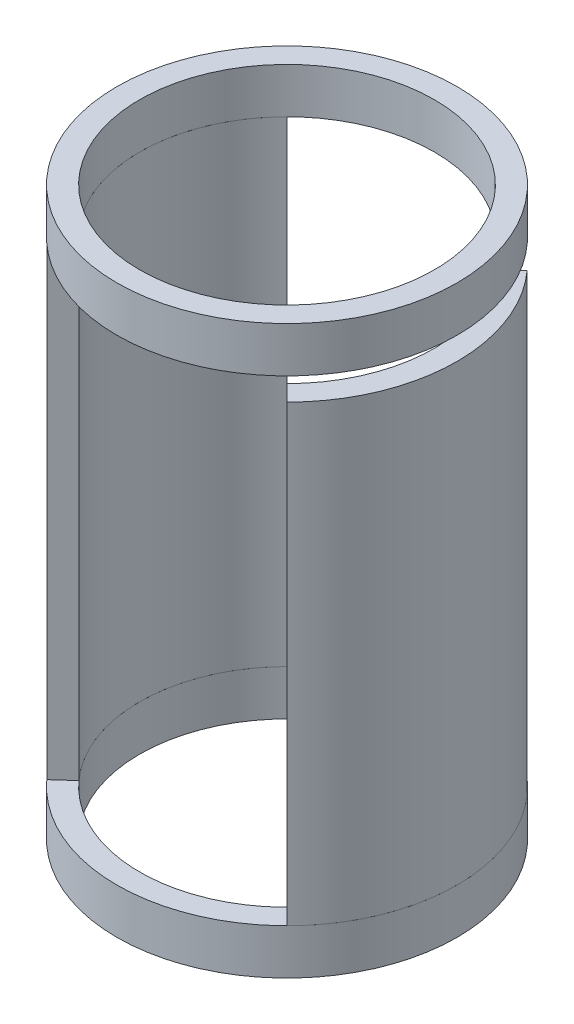
ISO-10303-21;
HEADER;
FILE_DESCRIPTION(('STEP AP214'),'2;1');
FILE_NAME('part.step','',(''),(''),'','','');
FILE_SCHEMA(('AUTOMOTIVE_DESIGN { 1 0 10303 214 1 1 1 1 }'));
ENDSEC;
DATA;
#1=APPLICATION_CONTEXT('core data for automotive mechanical design processes');
#2=APPLICATION_PROTOCOL_DEFINITION('international standard','automotive_design',2000,#1);
#3=PRODUCT_CONTEXT('',#1,'mechanical');
#4=PRODUCT('Part','Part','',(#3));
#5=PRODUCT_RELATED_PRODUCT_CATEGORY('part','',(#4));
#6=PRODUCT_DEFINITION_FORMATION('','',#4);
#7=PRODUCT_DEFINITION_CONTEXT('part definition',#1,'design');
#8=PRODUCT_DEFINITION('design','',#6,#7);
#9=PRODUCT_DEFINITION_SHAPE('','',#8);
#10=(LENGTH_UNIT() NAMED_UNIT(*) SI_UNIT(.MILLI.,.METRE.));
#11=(NAMED_UNIT(*) PLANE_ANGLE_UNIT() SI_UNIT($,.RADIAN.));
#12=(NAMED_UNIT(*) SI_UNIT($,.STERADIAN.) SOLID_ANGLE_UNIT());
#13=UNCERTAINTY_MEASURE_WITH_UNIT(LENGTH_MEASURE(1.E-05),#10,'distance_accuracy_value','');
#14=(GEOMETRIC_REPRESENTATION_CONTEXT(3) GLOBAL_UNCERTAINTY_ASSIGNED_CONTEXT((#13)) GLOBAL_UNIT_ASSIGNED_CONTEXT((#10,
#11,#12)) REPRESENTATION_CONTEXT('',''));
#15=CARTESIAN_POINT('',(0.,0.,0.));
#16=DIRECTION('',(0.,0.,1.));
#17=DIRECTION('',(1.,0.,0.));
#18=AXIS2_PLACEMENT_3D('',#15,#16,#17);
#19=CARTESIAN_POINT('',(0.,21.,0.));
#20=DIRECTION('',(0.,1.,0.));
#21=DIRECTION('',(0.,0.,1.));
#22=AXIS2_PLACEMENT_3D('',#19,#20,#21);
#23=PLANE('',#22);
#24=CARTESIAN_POINT('',(0.,21.,0.));
#25=DIRECTION('',(0.,1.,0.));
#26=DIRECTION('',(0.,0.,1.));
#27=AXIS2_PLACEMENT_3D('',#24,#25,#26);
#28=CIRCLE('',#27,6.5);
#29=CARTESIAN_POINT('',(0.,21.,6.5));
#30=VERTEX_POINT('',#29);
#31=EDGE_CURVE('E92',#30,#30,#28,.T.);
#32=ORIENTED_EDGE('',*,*,#31,.T.);
#33=EDGE_LOOP('',(#32));
#34=FACE_BOUND('',#33,.T.);
#35=CARTESIAN_POINT('',(0.,21.,0.));
#36=DIRECTION('',(0.,1.,0.));
#37=DIRECTION('',(0.,0.,1.));
#38=AXIS2_PLACEMENT_3D('',#35,#36,#37);
#39=CIRCLE('',#38,7.5);
#40=CARTESIAN_POINT('',(0.,21.,7.5));
#41=VERTEX_POINT('',#40);
#42=EDGE_CURVE('E81',#41,#41,#39,.T.);
#43=ORIENTED_EDGE('',*,*,#42,.F.);
#44=EDGE_LOOP('',(#43));
#45=FACE_BOUND('',#44,.T.);
#46=ADVANCED_FACE('F74',(#34,#45),#23,.F.);
#47=CARTESIAN_POINT('',(0.,23.,0.));
#48=DIRECTION('',(0.,1.,0.));
#49=DIRECTION('',(0.,0.,1.));
#50=AXIS2_PLACEMENT_3D('',#47,#48,#49);
#51=PLANE('',#50);
#52=CARTESIAN_POINT('',(0.,23.,0.));
#53=DIRECTION('',(0.,1.,0.));
#54=DIRECTION('',(0.,0.,1.));
#55=AXIS2_PLACEMENT_3D('',#52,#53,#54);
#56=CIRCLE('',#55,6.5);
#57=CARTESIAN_POINT('',(0.,23.,6.5));
#58=VERTEX_POINT('',#57);
#59=EDGE_CURVE('E87',#58,#58,#56,.T.);
#60=ORIENTED_EDGE('',*,*,#59,.F.);
#61=EDGE_LOOP('',(#60));
#62=FACE_BOUND('',#61,.T.);
#63=CARTESIAN_POINT('',(0.,23.,0.));
#64=DIRECTION('',(0.,1.,0.));
#65=DIRECTION('',(0.,0.,1.));
#66=AXIS2_PLACEMENT_3D('',#63,#64,#65);
#67=CIRCLE('',#66,7.5);
#68=CARTESIAN_POINT('',(0.,23.,7.5));
#69=VERTEX_POINT('',#68);
#70=EDGE_CURVE('E15',#69,#69,#67,.T.);
#71=ORIENTED_EDGE('',*,*,#70,.T.);
#72=EDGE_LOOP('',(#71));
#73=FACE_BOUND('',#72,.T.);
#74=ADVANCED_FACE('F107',(#62,#73),#51,.T.);
#75=CARTESIAN_POINT('',(0.,21.,0.));
#76=DIRECTION('',(0.,1.,0.));
#77=DIRECTION('',(0.,0.,1.));
#78=AXIS2_PLACEMENT_3D('',#75,#76,#77);
#79=CYLINDRICAL_SURFACE('',#78,7.5);
#80=ORIENTED_EDGE('',*,*,#42,.T.);
#81=EDGE_LOOP('',(#80));
#82=FACE_BOUND('',#81,.T.);
#83=ORIENTED_EDGE('',*,*,#70,.F.);
#84=EDGE_LOOP('',(#83));
#85=FACE_BOUND('',#84,.T.);
#86=ADVANCED_FACE('F103',(#82,#85),#79,.T.);
#87=CARTESIAN_POINT('',(0.,21.,0.));
#88=DIRECTION('',(0.,1.,0.));
#89=DIRECTION('',(0.,0.,1.));
#90=AXIS2_PLACEMENT_3D('',#87,#88,#89);
#91=CYLINDRICAL_SURFACE('',#90,6.5);
#92=ORIENTED_EDGE('',*,*,#31,.F.);
#93=EDGE_LOOP('',(#92));
#94=FACE_BOUND('',#93,.T.);
#95=ORIENTED_EDGE('',*,*,#59,.T.);
#96=EDGE_LOOP('',(#95));
#97=FACE_BOUND('',#96,.T.);
#98=ADVANCED_FACE('F100',(#94,#97),#91,.F.);
#99=CLOSED_SHELL('',(#46,#74,#86,#98));
#100=MANIFOLD_SOLID_BREP('B2',#99);
#101=CARTESIAN_POINT('',(0.,-2.,0.));
#102=DIRECTION('',(0.,1.,0.));
#103=DIRECTION('',(0.,0.,1.));
#104=AXIS2_PLACEMENT_3D('',#101,#102,#103);
#105=CYLINDRICAL_SURFACE('',#104,7.5);
#106=CARTESIAN_POINT('',(0.,-2.,0.));
#107=DIRECTION('',(0.,1.,0.));
#108=DIRECTION('',(0.,0.,1.));
#109=AXIS2_PLACEMENT_3D('',#106,#107,#108);
#110=CIRCLE('',#109,7.5);
#111=CARTESIAN_POINT('',(0.,-2.,7.5));
#112=VERTEX_POINT('',#111);
#113=EDGE_CURVE('E73',#112,#112,#110,.T.);
#114=ORIENTED_EDGE('',*,*,#113,.T.);
#115=EDGE_LOOP('',(#114));
#116=FACE_BOUND('',#115,.T.);
#117=CARTESIAN_POINT('',(0.,0.,0.));
#118=DIRECTION('',(0.,1.,0.));
#119=DIRECTION('',(0.,0.,1.));
#120=AXIS2_PLACEMENT_3D('',#117,#118,#119);
#121=CIRCLE('',#120,7.5);
#122=CARTESIAN_POINT('',(0.,0.,7.5));
#123=VERTEX_POINT('',#122);
#124=EDGE_CURVE('E167',#123,#123,#121,.T.);
#125=ORIENTED_EDGE('',*,*,#124,.F.);
#126=EDGE_LOOP('',(#125));
#127=FACE_BOUND('',#126,.T.);
#128=ADVANCED_FACE('F164',(#116,#127),#105,.T.);
#129=CARTESIAN_POINT('',(0.,-2.,0.));
#130=DIRECTION('',(0.,1.,0.));
#131=DIRECTION('',(0.,0.,1.));
#132=AXIS2_PLACEMENT_3D('',#129,#130,#131);
#133=PLANE('',#132);
#134=CARTESIAN_POINT('',(0.,-2.,0.));
#135=DIRECTION('',(0.,1.,0.));
#136=DIRECTION('',(1.,0.,0.));
#137=AXIS2_PLACEMENT_3D('',#134,#135,#136);
#138=CIRCLE('',#137,6.5);
#139=CARTESIAN_POINT('',(6.5,-2.,0.));
#140=VERTEX_POINT('',#139);
#141=EDGE_CURVE('E177',#140,#140,#138,.T.);
#142=ORIENTED_EDGE('',*,*,#141,.T.);
#143=EDGE_LOOP('',(#142));
#144=FACE_BOUND('',#143,.T.);
#145=ORIENTED_EDGE('',*,*,#113,.F.);
#146=EDGE_LOOP('',(#145));
#147=FACE_BOUND('',#146,.T.);
#148=ADVANCED_FACE('F186',(#144,#147),#133,.F.);
#149=CARTESIAN_POINT('',(0.,0.,0.));
#150=DIRECTION('',(0.,1.,0.));
#151=DIRECTION('',(0.,0.,1.));
#152=AXIS2_PLACEMENT_3D('',#149,#150,#151);
#153=PLANE('',#152);
#154=CARTESIAN_POINT('',(0.,0.,0.));
#155=DIRECTION('',(0.,1.,0.));
#156=DIRECTION('',(1.,0.,0.));
#157=AXIS2_PLACEMENT_3D('',#154,#155,#156);
#158=CIRCLE('',#157,6.5);
#159=CARTESIAN_POINT('',(6.5,0.,0.));
#160=VERTEX_POINT('',#159);
#161=EDGE_CURVE('E179',#160,#160,#158,.T.);
#162=ORIENTED_EDGE('',*,*,#161,.F.);
#163=EDGE_LOOP('',(#162));
#164=FACE_BOUND('',#163,.T.);
#165=ORIENTED_EDGE('',*,*,#124,.T.);
#166=EDGE_LOOP('',(#165));
#167=FACE_BOUND('',#166,.T.);
#168=ADVANCED_FACE('F192',(#164,#167),#153,.T.);
#169=CARTESIAN_POINT('',(0.,-2.,0.));
#170=DIRECTION('',(0.,1.,0.));
#171=DIRECTION('',(0.,0.,1.));
#172=AXIS2_PLACEMENT_3D('',#169,#170,#171);
#173=CYLINDRICAL_SURFACE('',#172,6.5);
#174=ORIENTED_EDGE('',*,*,#141,.F.);
#175=EDGE_LOOP('',(#174));
#176=FACE_BOUND('',#175,.T.);
#177=ORIENTED_EDGE('',*,*,#161,.T.);
#178=EDGE_LOOP('',(#177));
#179=FACE_BOUND('',#178,.T.);
#180=ADVANCED_FACE('F189',(#176,#179),#173,.F.);
#181=CLOSED_SHELL('',(#128,#148,#168,#180));
#182=MANIFOLD_SOLID_BREP('B10',#181);
#183=CARTESIAN_POINT('',(0.,21.,0.));
#184=DIRECTION('',(0.,-1.,0.));
#185=DIRECTION('',(0.,0.,-1.));
#186=AXIS2_PLACEMENT_3D('',#183,#184,#185);
#187=CYLINDRICAL_SURFACE('',#186,7.5);
#188=CARTESIAN_POINT('',(0.,20.,0.));
#189=DIRECTION('',(0.,1.,0.));
#190=DIRECTION('',(0.,0.,1.));
#191=AXIS2_PLACEMENT_3D('',#188,#189,#190);
#192=CIRCLE('',#191,7.5);
#193=CARTESIAN_POINT('',(5.30330085889911,20.,5.30330085889911));
#194=VERTEX_POINT('',#193);
#195=CARTESIAN_POINT('',(5.57358619108044,20.,-5.01847954769146));
#196=VERTEX_POINT('',#195);
#197=EDGE_CURVE('E296',#194,#196,#192,.T.);
#198=ORIENTED_EDGE('',*,*,#197,.F.);
#199=DIRECTION('',(0.,-1.,0.));
#200=VECTOR('',#199,1.);
#201=CARTESIAN_POINT('',(5.30330085889911,21.,5.30330085889911));
#202=LINE('',#201,#200);
#203=CARTESIAN_POINT('',(5.30330085889911,0.,5.30330085889911));
#204=VERTEX_POINT('',#203);
#205=EDGE_CURVE('E316',#194,#204,#202,.T.);
#206=ORIENTED_EDGE('',*,*,#205,.T.);
#207=CARTESIAN_POINT('',(0.,0.,0.));
#208=DIRECTION('',(0.,1.,0.));
#209=DIRECTION('',(0.,0.,1.));
#210=AXIS2_PLACEMENT_3D('',#207,#208,#209);
#211=CIRCLE('',#210,7.5);
#212=CARTESIAN_POINT('',(5.57358619108044,0.,-5.01847954769146));
#213=VERTEX_POINT('',#212);
#214=EDGE_CURVE('E162',#204,#213,#211,.T.);
#215=ORIENTED_EDGE('',*,*,#214,.T.);
#216=DIRECTION('',(0.,-1.,0.));
#217=VECTOR('',#216,1.);
#218=CARTESIAN_POINT('',(5.57358619108044,21.,-5.01847954769146));
#219=LINE('',#218,#217);
#220=EDGE_CURVE('E277',#196,#213,#219,.T.);
#221=ORIENTED_EDGE('',*,*,#220,.F.);
#222=EDGE_LOOP('',(#198,#206,#215,#221));
#223=FACE_BOUND('',#222,.T.);
#224=ADVANCED_FACE('F253',(#223),#187,.T.);
#225=CARTESIAN_POINT('',(4.83044136560305,21.,-4.3493489413326));
#226=DIRECTION('',(-0.669130606358861,0.,-0.743144825477391));
#227=DIRECTION('',(-0.743144825477392,0.,0.669130606358861));
#228=AXIS2_PLACEMENT_3D('',#225,#226,#227);
#229=PLANE('',#228);
#230=DIRECTION('',(0.,-1.,0.));
#231=VECTOR('',#230,1.);
#232=CARTESIAN_POINT('',(4.83044136560305,21.,-4.3493489413326));
#233=LINE('',#232,#231);
#234=CARTESIAN_POINT('',(4.83044136560305,20.,-4.3493489413326));
#235=VERTEX_POINT('',#234);
#236=CARTESIAN_POINT('',(4.83044136560305,0.,-4.3493489413326));
#237=VERTEX_POINT('',#236);
#238=EDGE_CURVE('E305',#235,#237,#233,.T.);
#239=ORIENTED_EDGE('',*,*,#238,.F.);
#240=DIRECTION('',(0.743144825477392,0.,-0.669130606358861));
#241=VECTOR('',#240,1.);
#242=CARTESIAN_POINT('',(4.83044136560305,20.,-4.3493489413326));
#243=LINE('',#242,#241);
#244=EDGE_CURVE('E293',#235,#196,#243,.T.);
#245=ORIENTED_EDGE('',*,*,#244,.T.);
#246=ORIENTED_EDGE('',*,*,#220,.T.);
#247=DIRECTION('',(0.743144825477392,0.,-0.669130606358861));
#248=VECTOR('',#247,1.);
#249=CARTESIAN_POINT('',(4.83044136560305,0.,-4.3493489413326));
#250=LINE('',#249,#248);
#251=EDGE_CURVE('E262',#237,#213,#250,.T.);
#252=ORIENTED_EDGE('',*,*,#251,.F.);
#253=EDGE_LOOP('',(#239,#245,#246,#252));
#254=FACE_BOUND('',#253,.T.);
#255=ADVANCED_FACE('F309',(#254),#229,.T.);
#256=CARTESIAN_POINT('',(0.,21.,0.));
#257=DIRECTION('',(0.,-1.,0.));
#258=DIRECTION('',(0.,0.,-1.));
#259=AXIS2_PLACEMENT_3D('',#256,#257,#258);
#260=CYLINDRICAL_SURFACE('',#259,6.5);
#261=DIRECTION('',(0.,-1.,0.));
#262=VECTOR('',#261,1.);
#263=CARTESIAN_POINT('',(4.59619407771256,21.,4.59619407771256));
#264=LINE('',#263,#262);
#265=CARTESIAN_POINT('',(4.59619407771256,20.,4.59619407771256));
#266=VERTEX_POINT('',#265);
#267=CARTESIAN_POINT('',(4.59619407771256,0.,4.59619407771256));
#268=VERTEX_POINT('',#267);
#269=EDGE_CURVE('E306',#266,#268,#264,.T.);
#270=ORIENTED_EDGE('',*,*,#269,.F.);
#271=CARTESIAN_POINT('',(0.,20.,0.));
#272=DIRECTION('',(0.,1.,0.));
#273=DIRECTION('',(0.,0.,1.));
#274=AXIS2_PLACEMENT_3D('',#271,#272,#273);
#275=CIRCLE('',#274,6.5);
#276=EDGE_CURVE('E269',#235,#266,#275,.F.);
#277=ORIENTED_EDGE('',*,*,#276,.F.);
#278=ORIENTED_EDGE('',*,*,#238,.T.);
#279=CARTESIAN_POINT('',(0.,0.,0.));
#280=DIRECTION('',(0.,1.,0.));
#281=DIRECTION('',(1.,0.,0.));
#282=AXIS2_PLACEMENT_3D('',#279,#280,#281);
#283=CIRCLE('',#282,6.5);
#284=EDGE_CURVE('E328',#268,#237,#283,.T.);
#285=ORIENTED_EDGE('',*,*,#284,.F.);
#286=EDGE_LOOP('',(#270,#277,#278,#285));
#287=FACE_BOUND('',#286,.T.);
#288=ADVANCED_FACE('F303',(#287),#260,.F.);
#289=CARTESIAN_POINT('',(5.30330085889911,21.,5.30330085889911));
#290=DIRECTION('',(-0.707106781186546,0.,0.707106781186549));
#291=DIRECTION('',(0.707106781186549,0.,0.707106781186546));
#292=AXIS2_PLACEMENT_3D('',#289,#290,#291);
#293=PLANE('',#292);
#294=ORIENTED_EDGE('',*,*,#205,.F.);
#295=DIRECTION('',(-0.707106781186549,0.,-0.707106781186546));
#296=VECTOR('',#295,1.);
#297=CARTESIAN_POINT('',(5.30330085889911,20.,5.30330085889911));
#298=LINE('',#297,#296);
#299=EDGE_CURVE('E299',#194,#266,#298,.T.);
#300=ORIENTED_EDGE('',*,*,#299,.T.);
#301=ORIENTED_EDGE('',*,*,#269,.T.);
#302=DIRECTION('',(-0.707106781186549,0.,-0.707106781186546));
#303=VECTOR('',#302,1.);
#304=CARTESIAN_POINT('',(5.30330085889911,0.,5.30330085889911));
#305=LINE('',#304,#303);
#306=EDGE_CURVE('E324',#204,#268,#305,.T.);
#307=ORIENTED_EDGE('',*,*,#306,.F.);
#308=EDGE_LOOP('',(#294,#300,#301,#307));
#309=FACE_BOUND('',#308,.T.);
#310=ADVANCED_FACE('F336',(#309),#293,.T.);
#311=CARTESIAN_POINT('',(0.,0.,0.));
#312=DIRECTION('',(0.,1.,0.));
#313=DIRECTION('',(1.,0.,0.));
#314=AXIS2_PLACEMENT_3D('',#311,#312,#313);
#315=PLANE('',#314);
#316=ORIENTED_EDGE('',*,*,#214,.F.);
#317=ORIENTED_EDGE('',*,*,#306,.T.);
#318=ORIENTED_EDGE('',*,*,#284,.T.);
#319=ORIENTED_EDGE('',*,*,#251,.T.);
#320=EDGE_LOOP('',(#316,#317,#318,#319));
#321=FACE_BOUND('',#320,.T.);
#322=ADVANCED_FACE('F255',(#321),#315,.F.);
#323=CARTESIAN_POINT('',(0.,20.,0.));
#324=DIRECTION('',(0.,1.,0.));
#325=DIRECTION('',(1.,0.,0.));
#326=AXIS2_PLACEMENT_3D('',#323,#324,#325);
#327=PLANE('',#326);
#328=ORIENTED_EDGE('',*,*,#197,.T.);
#329=ORIENTED_EDGE('',*,*,#244,.F.);
#330=ORIENTED_EDGE('',*,*,#276,.T.);
#331=ORIENTED_EDGE('',*,*,#299,.F.);
#332=EDGE_LOOP('',(#328,#329,#330,#331));
#333=FACE_BOUND('',#332,.T.);
#334=ADVANCED_FACE('F294',(#333),#327,.T.);
#335=CLOSED_SHELL('',(#224,#255,#288,#310,#322,#334));
#336=MANIFOLD_SOLID_BREP('B68',#335);
#337=CARTESIAN_POINT('',(0.,21.,0.));
#338=DIRECTION('',(0.,-1.,0.));
#339=DIRECTION('',(0.,0.,-1.));
#340=AXIS2_PLACEMENT_3D('',#337,#338,#339);
#341=CYLINDRICAL_SURFACE('',#340,7.5);
#342=CARTESIAN_POINT('',(0.,0.,0.));
#343=DIRECTION('',(0.,1.,0.));
#344=DIRECTION('',(0.,0.,1.));
#345=AXIS2_PLACEMENT_3D('',#342,#343,#344);
#346=CIRCLE('',#345,7.5);
#347=CARTESIAN_POINT('',(-5.30330085889911,0.,-5.30330085889911));
#348=VERTEX_POINT('',#347);
#349=CARTESIAN_POINT('',(-5.57358619108044,0.,5.01847954769145));
#350=VERTEX_POINT('',#349);
#351=EDGE_CURVE('E473',#348,#350,#346,.T.);
#352=ORIENTED_EDGE('',*,*,#351,.T.);
#353=DIRECTION('',(0.,-1.,0.));
#354=VECTOR('',#353,1.);
#355=CARTESIAN_POINT('',(-5.57358619108044,21.,5.01847954769145));
#356=LINE('',#355,#354);
#357=CARTESIAN_POINT('',(-5.57358619108044,21.,5.01847954769145));
#358=VERTEX_POINT('',#357);
#359=EDGE_CURVE('E251',#358,#350,#356,.T.);
#360=ORIENTED_EDGE('',*,*,#359,.F.);
#361=CARTESIAN_POINT('',(0.,21.,0.));
#362=DIRECTION('',(0.,1.,0.));
#363=DIRECTION('',(0.,0.,1.));
#364=AXIS2_PLACEMENT_3D('',#361,#362,#363);
#365=CIRCLE('',#364,7.5);
#366=CARTESIAN_POINT('',(-5.30330085889911,21.,-5.30330085889911));
#367=VERTEX_POINT('',#366);
#368=EDGE_CURVE('E444',#367,#358,#365,.T.);
#369=ORIENTED_EDGE('',*,*,#368,.F.);
#370=DIRECTION('',(0.,-1.,0.));
#371=VECTOR('',#370,1.);
#372=CARTESIAN_POINT('',(-5.30330085889911,21.,-5.30330085889911));
#373=LINE('',#372,#371);
#374=EDGE_CURVE('E420',#367,#348,#373,.T.);
#375=ORIENTED_EDGE('',*,*,#374,.T.);
#376=EDGE_LOOP('',(#352,#360,#369,#375));
#377=FACE_BOUND('',#376,.T.);
#378=ADVANCED_FACE('F403',(#377),#341,.T.);
#379=CARTESIAN_POINT('',(-4.83044136560305,21.,4.34934894133259));
#380=DIRECTION('',(0.669130606358862,0.,0.743144825477391));
#381=DIRECTION('',(0.743144825477391,0.,-0.669130606358862));
#382=AXIS2_PLACEMENT_3D('',#379,#380,#381);
#383=PLANE('',#382);
#384=DIRECTION('',(-0.743144825477391,0.,0.669130606358862));
#385=VECTOR('',#384,1.);
#386=CARTESIAN_POINT('',(-4.83044136560305,0.,4.34934894133259));
#387=LINE('',#386,#385);
#388=CARTESIAN_POINT('',(-4.83044136560305,0.,4.34934894133259));
#389=VERTEX_POINT('',#388);
#390=EDGE_CURVE('E453',#389,#350,#387,.T.);
#391=ORIENTED_EDGE('',*,*,#390,.F.);
#392=DIRECTION('',(0.,-1.,0.));
#393=VECTOR('',#392,1.);
#394=CARTESIAN_POINT('',(-4.83044136560305,21.,4.34934894133259));
#395=LINE('',#394,#393);
#396=CARTESIAN_POINT('',(-4.83044136560305,21.,4.34934894133259));
#397=VERTEX_POINT('',#396);
#398=EDGE_CURVE('E412',#397,#389,#395,.T.);
#399=ORIENTED_EDGE('',*,*,#398,.F.);
#400=DIRECTION('',(-0.743144825477391,0.,0.669130606358862));
#401=VECTOR('',#400,1.);
#402=CARTESIAN_POINT('',(-4.83044136560305,21.,4.34934894133259));
#403=LINE('',#402,#401);
#404=EDGE_CURVE('E451',#397,#358,#403,.T.);
#405=ORIENTED_EDGE('',*,*,#404,.T.);
#406=ORIENTED_EDGE('',*,*,#359,.T.);
#407=EDGE_LOOP('',(#391,#399,#405,#406));
#408=FACE_BOUND('',#407,.T.);
#409=ADVANCED_FACE('F450',(#408),#383,.T.);
#410=CARTESIAN_POINT('',(0.,21.,0.));
#411=DIRECTION('',(0.,-1.,0.));
#412=DIRECTION('',(0.,0.,-1.));
#413=AXIS2_PLACEMENT_3D('',#410,#411,#412);
#414=CYLINDRICAL_SURFACE('',#413,6.5);
#415=CARTESIAN_POINT('',(0.,0.,0.));
#416=DIRECTION('',(0.,1.,0.));
#417=DIRECTION('',(1.,0.,0.));
#418=AXIS2_PLACEMENT_3D('',#415,#416,#417);
#419=CIRCLE('',#418,6.5);
#420=CARTESIAN_POINT('',(-4.59619407771256,0.,-4.59619407771256));
#421=VERTEX_POINT('',#420);
#422=EDGE_CURVE('E478',#421,#389,#419,.T.);
#423=ORIENTED_EDGE('',*,*,#422,.F.);
#424=DIRECTION('',(0.,-1.,0.));
#425=VECTOR('',#424,1.);
#426=CARTESIAN_POINT('',(-4.59619407771256,21.,-4.59619407771256));
#427=LINE('',#426,#425);
#428=CARTESIAN_POINT('',(-4.59619407771256,21.,-4.59619407771256));
#429=VERTEX_POINT('',#428);
#430=EDGE_CURVE('E433',#429,#421,#427,.T.);
#431=ORIENTED_EDGE('',*,*,#430,.F.);
#432=CARTESIAN_POINT('',(0.,21.,0.));
#433=DIRECTION('',(0.,1.,0.));
#434=DIRECTION('',(1.,0.,0.));
#435=AXIS2_PLACEMENT_3D('',#432,#433,#434);
#436=CIRCLE('',#435,6.5);
#437=EDGE_CURVE('E460',#429,#397,#436,.T.);
#438=ORIENTED_EDGE('',*,*,#437,.T.);
#439=ORIENTED_EDGE('',*,*,#398,.T.);
#440=EDGE_LOOP('',(#423,#431,#438,#439));
#441=FACE_BOUND('',#440,.T.);
#442=ADVANCED_FACE('F463',(#441),#414,.F.);
#443=CARTESIAN_POINT('',(-5.30330085889911,21.,-5.30330085889911));
#444=DIRECTION('',(0.707106781186548,0.,-0.707106781186547));
#445=DIRECTION('',(-0.707106781186547,0.,-0.707106781186548));
#446=AXIS2_PLACEMENT_3D('',#443,#444,#445);
#447=PLANE('',#446);
#448=DIRECTION('',(0.707106781186547,0.,0.707106781186548));
#449=VECTOR('',#448,1.);
#450=CARTESIAN_POINT('',(-5.30330085889911,0.,-5.30330085889911));
#451=LINE('',#450,#449);
#452=EDGE_CURVE('E481',#348,#421,#451,.T.);
#453=ORIENTED_EDGE('',*,*,#452,.F.);
#454=ORIENTED_EDGE('',*,*,#374,.F.);
#455=DIRECTION('',(0.707106781186547,0.,0.707106781186548));
#456=VECTOR('',#455,1.);
#457=CARTESIAN_POINT('',(-5.30330085889911,21.,-5.30330085889911));
#458=LINE('',#457,#456);
#459=EDGE_CURVE('E465',#367,#429,#458,.T.);
#460=ORIENTED_EDGE('',*,*,#459,.T.);
#461=ORIENTED_EDGE('',*,*,#430,.T.);
#462=EDGE_LOOP('',(#453,#454,#460,#461));
#463=FACE_BOUND('',#462,.T.);
#464=ADVANCED_FACE('F489',(#463),#447,.T.);
#465=CARTESIAN_POINT('',(0.,21.,0.));
#466=DIRECTION('',(0.,1.,0.));
#467=DIRECTION('',(1.,0.,0.));
#468=AXIS2_PLACEMENT_3D('',#465,#466,#467);
#469=PLANE('',#468);
#470=ORIENTED_EDGE('',*,*,#368,.T.);
#471=ORIENTED_EDGE('',*,*,#404,.F.);
#472=ORIENTED_EDGE('',*,*,#437,.F.);
#473=ORIENTED_EDGE('',*,*,#459,.F.);
#474=EDGE_LOOP('',(#470,#471,#472,#473));
#475=FACE_BOUND('',#474,.T.);
#476=ADVANCED_FACE('F459',(#475),#469,.T.);
#477=CARTESIAN_POINT('',(0.,0.,0.));
#478=DIRECTION('',(0.,1.,0.));
#479=DIRECTION('',(1.,0.,0.));
#480=AXIS2_PLACEMENT_3D('',#477,#478,#479);
#481=PLANE('',#480);
#482=ORIENTED_EDGE('',*,*,#351,.F.);
#483=ORIENTED_EDGE('',*,*,#452,.T.);
#484=ORIENTED_EDGE('',*,*,#422,.T.);
#485=ORIENTED_EDGE('',*,*,#390,.T.);
#486=EDGE_LOOP('',(#482,#483,#484,#485));
#487=FACE_BOUND('',#486,.T.);
#488=ADVANCED_FACE('F488',(#487),#481,.F.);
#489=CLOSED_SHELL('',(#378,#409,#442,#464,#476,#488));
#490=MANIFOLD_SOLID_BREP('B156',#489);
#491=ADVANCED_BREP_SHAPE_REPRESENTATION('',(#18,#100,#182,#336,#490),#14);
#492=SHAPE_DEFINITION_REPRESENTATION(#9,#491);
ENDSEC;
END-ISO-10303-21;
